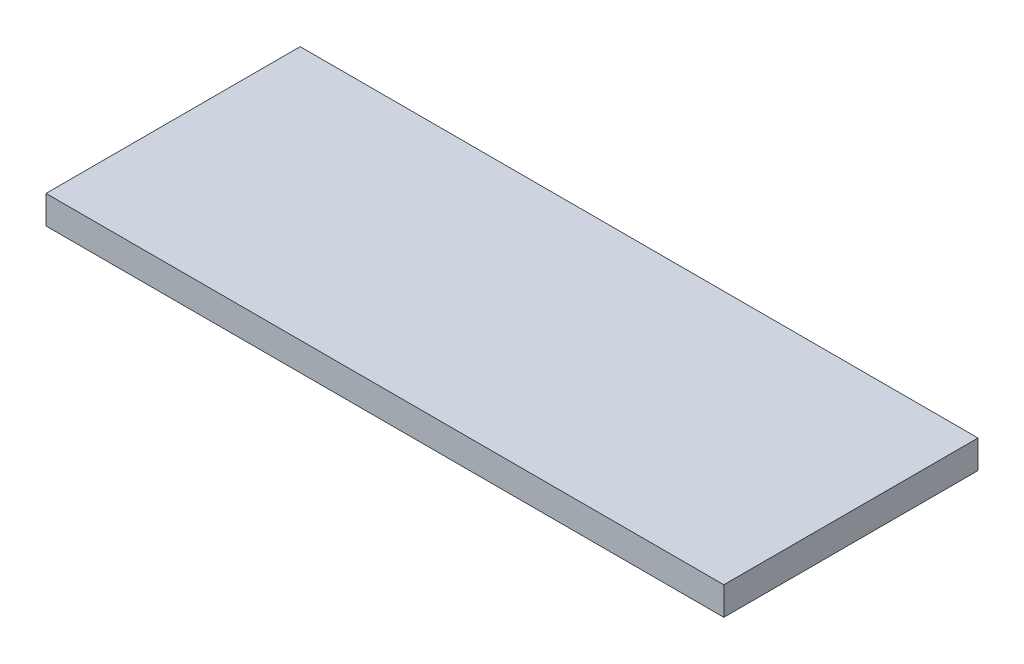
ISO-10303-21;
HEADER;
FILE_DESCRIPTION(('STEP AP214'),'2;1');
FILE_NAME('part.step','',(''),(''),'','','');
FILE_SCHEMA(('AUTOMOTIVE_DESIGN { 1 0 10303 214 1 1 1 1 }'));
ENDSEC;
DATA;
#1=APPLICATION_CONTEXT('core data for automotive mechanical design processes');
#2=APPLICATION_PROTOCOL_DEFINITION('international standard','automotive_design',2000,#1);
#3=PRODUCT_CONTEXT('',#1,'mechanical');
#4=PRODUCT('Part','Part','',(#3));
#5=PRODUCT_RELATED_PRODUCT_CATEGORY('part','',(#4));
#6=PRODUCT_DEFINITION_FORMATION('','',#4);
#7=PRODUCT_DEFINITION_CONTEXT('part definition',#1,'design');
#8=PRODUCT_DEFINITION('design','',#6,#7);
#9=PRODUCT_DEFINITION_SHAPE('','',#8);
#10=(LENGTH_UNIT() NAMED_UNIT(*) SI_UNIT(.MILLI.,.METRE.));
#11=(NAMED_UNIT(*) PLANE_ANGLE_UNIT() SI_UNIT($,.RADIAN.));
#12=(NAMED_UNIT(*) SI_UNIT($,.STERADIAN.) SOLID_ANGLE_UNIT());
#13=UNCERTAINTY_MEASURE_WITH_UNIT(LENGTH_MEASURE(1.E-05),#10,'distance_accuracy_value','');
#14=(GEOMETRIC_REPRESENTATION_CONTEXT(3) GLOBAL_UNCERTAINTY_ASSIGNED_CONTEXT((#13)) GLOBAL_UNIT_ASSIGNED_CONTEXT((#10,
#11,#12)) REPRESENTATION_CONTEXT('',''));
#15=CARTESIAN_POINT('',(0.,0.,0.));
#16=DIRECTION('',(0.,0.,1.));
#17=DIRECTION('',(1.,0.,0.));
#18=AXIS2_PLACEMENT_3D('',#15,#16,#17);
#19=CARTESIAN_POINT('',(-52.2265444927257,12.7,-96.9031387054854));
#20=DIRECTION('',(1.,0.,0.));
#21=DIRECTION('',(0.,0.,-1.));
#22=AXIS2_PLACEMENT_3D('',#19,#20,#21);
#23=PLANE('',#22);
#24=DIRECTION('',(0.,0.,1.));
#25=VECTOR('',#24,1.);
#26=CARTESIAN_POINT('',(-52.2265444927257,0.,-96.9031387054854));
#27=LINE('',#26,#25);
#28=CARTESIAN_POINT('',(-52.2265444927257,0.,-96.9031387054854));
#29=VERTEX_POINT('',#28);
#30=CARTESIAN_POINT('',(-52.2265444927257,0.,17.3968612945146));
#31=VERTEX_POINT('',#30);
#32=EDGE_CURVE('E96',#29,#31,#27,.T.);
#33=ORIENTED_EDGE('',*,*,#32,.T.);
#34=DIRECTION('',(0.,-1.,0.));
#35=VECTOR('',#34,1.);
#36=CARTESIAN_POINT('',(-52.2265444927257,12.7,17.3968612945146));
#37=LINE('',#36,#35);
#38=CARTESIAN_POINT('',(-52.2265444927257,12.7,17.3968612945146));
#39=VERTEX_POINT('',#38);
#40=EDGE_CURVE('E11',#39,#31,#37,.T.);
#41=ORIENTED_EDGE('',*,*,#40,.F.);
#42=DIRECTION('',(0.,0.,1.));
#43=VECTOR('',#42,1.);
#44=CARTESIAN_POINT('',(-52.2265444927257,12.7,-96.9031387054854));
#45=LINE('',#44,#43);
#46=CARTESIAN_POINT('',(-52.2265444927257,12.7,-96.9031387054854));
#47=VERTEX_POINT('',#46);
#48=EDGE_CURVE('E84',#47,#39,#45,.T.);
#49=ORIENTED_EDGE('',*,*,#48,.F.);
#50=DIRECTION('',(0.,-1.,0.));
#51=VECTOR('',#50,1.);
#52=CARTESIAN_POINT('',(-52.2265444927257,12.7,-96.9031387054854));
#53=LINE('',#52,#51);
#54=EDGE_CURVE('E92',#47,#29,#53,.T.);
#55=ORIENTED_EDGE('',*,*,#54,.T.);
#56=EDGE_LOOP('',(#33,#41,#49,#55));
#57=FACE_BOUND('',#56,.T.);
#58=ADVANCED_FACE('F33',(#57),#23,.F.);
#59=CARTESIAN_POINT('',(-52.2265444927257,12.7,17.3968612945146));
#60=DIRECTION('',(0.,0.,-1.));
#61=DIRECTION('',(-1.,0.,0.));
#62=AXIS2_PLACEMENT_3D('',#59,#60,#61);
#63=PLANE('',#62);
#64=DIRECTION('',(1.,0.,0.));
#65=VECTOR('',#64,1.);
#66=CARTESIAN_POINT('',(-52.2265444927257,0.,17.3968612945146));
#67=LINE('',#66,#65);
#68=CARTESIAN_POINT('',(252.573455507274,0.,17.3968612945146));
#69=VERTEX_POINT('',#68);
#70=EDGE_CURVE('E88',#31,#69,#67,.T.);
#71=ORIENTED_EDGE('',*,*,#70,.T.);
#72=DIRECTION('',(0.,-1.,0.));
#73=VECTOR('',#72,1.);
#74=CARTESIAN_POINT('',(252.573455507274,12.7,17.3968612945146));
#75=LINE('',#74,#73);
#76=CARTESIAN_POINT('',(252.573455507274,12.7,17.3968612945146));
#77=VERTEX_POINT('',#76);
#78=EDGE_CURVE('E41',#77,#69,#75,.T.);
#79=ORIENTED_EDGE('',*,*,#78,.F.);
#80=DIRECTION('',(1.,0.,0.));
#81=VECTOR('',#80,1.);
#82=CARTESIAN_POINT('',(-52.2265444927257,12.7,17.3968612945146));
#83=LINE('',#82,#81);
#84=EDGE_CURVE('E79',#39,#77,#83,.T.);
#85=ORIENTED_EDGE('',*,*,#84,.F.);
#86=ORIENTED_EDGE('',*,*,#40,.T.);
#87=EDGE_LOOP('',(#71,#79,#85,#86));
#88=FACE_BOUND('',#87,.T.);
#89=ADVANCED_FACE('F87',(#88),#63,.F.);
#90=CARTESIAN_POINT('',(252.573455507274,12.7,-96.9031387054854));
#91=DIRECTION('',(-1.,0.,0.));
#92=DIRECTION('',(0.,0.,1.));
#93=AXIS2_PLACEMENT_3D('',#90,#91,#92);
#94=PLANE('',#93);
#95=DIRECTION('',(0.,0.,-1.));
#96=VECTOR('',#95,1.);
#97=CARTESIAN_POINT('',(252.573455507274,0.,-96.9031387054854));
#98=LINE('',#97,#96);
#99=CARTESIAN_POINT('',(252.573455507274,0.,-96.9031387054854));
#100=VERTEX_POINT('',#99);
#101=EDGE_CURVE('E66',#69,#100,#98,.T.);
#102=ORIENTED_EDGE('',*,*,#101,.T.);
#103=DIRECTION('',(0.,-1.,0.));
#104=VECTOR('',#103,1.);
#105=CARTESIAN_POINT('',(252.573455507274,12.7,-96.9031387054854));
#106=LINE('',#105,#104);
#107=CARTESIAN_POINT('',(252.573455507274,12.7,-96.9031387054854));
#108=VERTEX_POINT('',#107);
#109=EDGE_CURVE('E89',#108,#100,#106,.T.);
#110=ORIENTED_EDGE('',*,*,#109,.F.);
#111=DIRECTION('',(0.,0.,-1.));
#112=VECTOR('',#111,1.);
#113=CARTESIAN_POINT('',(252.573455507274,12.7,-96.9031387054854));
#114=LINE('',#113,#112);
#115=EDGE_CURVE('E82',#77,#108,#114,.T.);
#116=ORIENTED_EDGE('',*,*,#115,.F.);
#117=ORIENTED_EDGE('',*,*,#78,.T.);
#118=EDGE_LOOP('',(#102,#110,#116,#117));
#119=FACE_BOUND('',#118,.T.);
#120=ADVANCED_FACE('F90',(#119),#94,.F.);
#121=CARTESIAN_POINT('',(-52.2265444927257,12.7,-96.9031387054854));
#122=DIRECTION('',(0.,0.,1.));
#123=DIRECTION('',(1.,0.,0.));
#124=AXIS2_PLACEMENT_3D('',#121,#122,#123);
#125=PLANE('',#124);
#126=DIRECTION('',(-1.,0.,0.));
#127=VECTOR('',#126,1.);
#128=CARTESIAN_POINT('',(-52.2265444927257,0.,-96.9031387054854));
#129=LINE('',#128,#127);
#130=EDGE_CURVE('E72',#100,#29,#129,.T.);
#131=ORIENTED_EDGE('',*,*,#130,.T.);
#132=ORIENTED_EDGE('',*,*,#54,.F.);
#133=DIRECTION('',(-1.,0.,0.));
#134=VECTOR('',#133,1.);
#135=CARTESIAN_POINT('',(-52.2265444927257,12.7,-96.9031387054854));
#136=LINE('',#135,#134);
#137=EDGE_CURVE('E49',#108,#47,#136,.T.);
#138=ORIENTED_EDGE('',*,*,#137,.F.);
#139=ORIENTED_EDGE('',*,*,#109,.T.);
#140=EDGE_LOOP('',(#131,#132,#138,#139));
#141=FACE_BOUND('',#140,.T.);
#142=ADVANCED_FACE('F103',(#141),#125,.F.);
#143=CARTESIAN_POINT('',(0.,12.7,0.));
#144=DIRECTION('',(0.,1.,0.));
#145=DIRECTION('',(0.,0.,1.));
#146=AXIS2_PLACEMENT_3D('',#143,#144,#145);
#147=PLANE('',#146);
#148=ORIENTED_EDGE('',*,*,#48,.T.);
#149=ORIENTED_EDGE('',*,*,#84,.T.);
#150=ORIENTED_EDGE('',*,*,#115,.T.);
#151=ORIENTED_EDGE('',*,*,#137,.T.);
#152=EDGE_LOOP('',(#148,#149,#150,#151));
#153=FACE_BOUND('',#152,.T.);
#154=ADVANCED_FACE('F80',(#153),#147,.T.);
#155=CARTESIAN_POINT('',(0.,0.,0.));
#156=DIRECTION('',(0.,1.,0.));
#157=DIRECTION('',(0.,0.,1.));
#158=AXIS2_PLACEMENT_3D('',#155,#156,#157);
#159=PLANE('',#158);
#160=ORIENTED_EDGE('',*,*,#32,.F.);
#161=ORIENTED_EDGE('',*,*,#130,.F.);
#162=ORIENTED_EDGE('',*,*,#101,.F.);
#163=ORIENTED_EDGE('',*,*,#70,.F.);
#164=EDGE_LOOP('',(#160,#161,#162,#163));
#165=FACE_BOUND('',#164,.T.);
#166=ADVANCED_FACE('F106',(#165),#159,.F.);
#167=CLOSED_SHELL('',(#58,#89,#120,#142,#154,#166));
#168=MANIFOLD_SOLID_BREP('B2',#167);
#169=ADVANCED_BREP_SHAPE_REPRESENTATION('',(#18,#168),#14);
#170=SHAPE_DEFINITION_REPRESENTATION(#9,#169);
ENDSEC;
END-ISO-10303-21;
